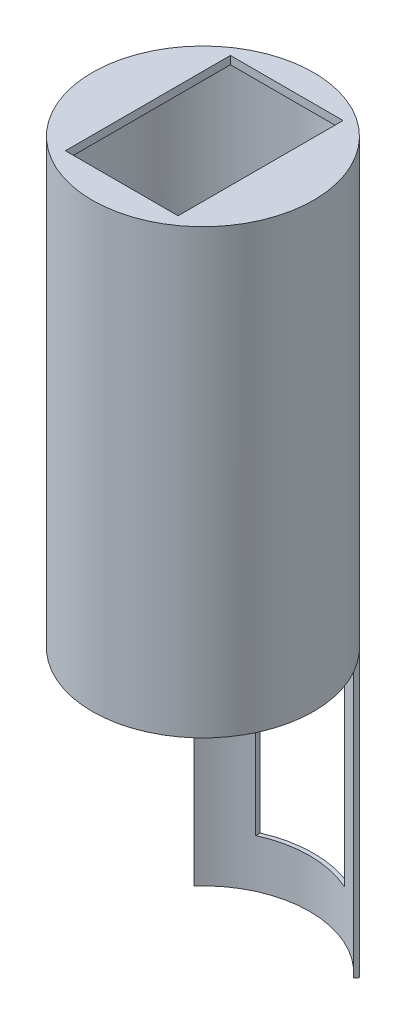
ISO-10303-21;
HEADER;
FILE_DESCRIPTION(('STEP AP214'),'2;1');
FILE_NAME('part.step','',(''),(''),'','','');
FILE_SCHEMA(('AUTOMOTIVE_DESIGN { 1 0 10303 214 1 1 1 1 }'));
ENDSEC;
DATA;
#1=APPLICATION_CONTEXT('core data for automotive mechanical design processes');
#2=APPLICATION_PROTOCOL_DEFINITION('international standard','automotive_design',2000,#1);
#3=PRODUCT_CONTEXT('',#1,'mechanical');
#4=PRODUCT('Part','Part','',(#3));
#5=PRODUCT_RELATED_PRODUCT_CATEGORY('part','',(#4));
#6=PRODUCT_DEFINITION_FORMATION('','',#4);
#7=PRODUCT_DEFINITION_CONTEXT('part definition',#1,'design');
#8=PRODUCT_DEFINITION('design','',#6,#7);
#9=PRODUCT_DEFINITION_SHAPE('','',#8);
#10=(LENGTH_UNIT() NAMED_UNIT(*) SI_UNIT(.MILLI.,.METRE.));
#11=(NAMED_UNIT(*) PLANE_ANGLE_UNIT() SI_UNIT($,.RADIAN.));
#12=(NAMED_UNIT(*) SI_UNIT($,.STERADIAN.) SOLID_ANGLE_UNIT());
#13=UNCERTAINTY_MEASURE_WITH_UNIT(LENGTH_MEASURE(1.E-05),#10,'distance_accuracy_value','');
#14=(GEOMETRIC_REPRESENTATION_CONTEXT(3) GLOBAL_UNCERTAINTY_ASSIGNED_CONTEXT((#13)) GLOBAL_UNIT_ASSIGNED_CONTEXT((#10,
#11,#12)) REPRESENTATION_CONTEXT('',''));
#15=CARTESIAN_POINT('',(0.,0.,0.));
#16=DIRECTION('',(0.,0.,1.));
#17=DIRECTION('',(1.,0.,0.));
#18=AXIS2_PLACEMENT_3D('',#15,#16,#17);
#19=CARTESIAN_POINT('',(0.,110.,0.));
#20=DIRECTION('',(0.,1.,0.));
#21=DIRECTION('',(0.,0.,1.));
#22=AXIS2_PLACEMENT_3D('',#19,#20,#21);
#23=PLANE('',#22);
#24=CARTESIAN_POINT('',(0.,110.,0.));
#25=DIRECTION('',(0.,1.,0.));
#26=DIRECTION('',(0.,0.,1.));
#27=AXIS2_PLACEMENT_3D('',#24,#25,#26);
#28=CIRCLE('',#27,27.5);
#29=CARTESIAN_POINT('',(0.,110.,27.5));
#30=VERTEX_POINT('',#29);
#31=EDGE_CURVE('E223',#30,#30,#28,.T.);
#32=ORIENTED_EDGE('',*,*,#31,.T.);
#33=EDGE_LOOP('',(#32));
#34=FACE_BOUND('',#33,.T.);
#35=DIRECTION('',(-1.,0.,0.));
#36=VECTOR('',#35,1.);
#37=CARTESIAN_POINT('',(0.,110.,20.1795265690119));
#38=LINE('',#37,#36);
#39=CARTESIAN_POINT('',(14.,110.,20.1795265690119));
#40=VERTEX_POINT('',#39);
#41=CARTESIAN_POINT('',(-14.,110.,20.1795265690119));
#42=VERTEX_POINT('',#41);
#43=EDGE_CURVE('E143',#40,#42,#38,.T.);
#44=ORIENTED_EDGE('',*,*,#43,.T.);
#45=DIRECTION('',(0.,0.,-1.));
#46=VECTOR('',#45,1.);
#47=CARTESIAN_POINT('',(-14.,110.,0.));
#48=LINE('',#47,#46);
#49=CARTESIAN_POINT('',(-14.,110.,-20.8204734309881));
#50=VERTEX_POINT('',#49);
#51=EDGE_CURVE('E136',#42,#50,#48,.T.);
#52=ORIENTED_EDGE('',*,*,#51,.T.);
#53=DIRECTION('',(1.,0.,0.));
#54=VECTOR('',#53,1.);
#55=CARTESIAN_POINT('',(0.,110.,-20.8204734309881));
#56=LINE('',#55,#54);
#57=CARTESIAN_POINT('',(14.,110.,-20.8204734309881));
#58=VERTEX_POINT('',#57);
#59=EDGE_CURVE('E124',#50,#58,#56,.T.);
#60=ORIENTED_EDGE('',*,*,#59,.T.);
#61=DIRECTION('',(0.,0.,1.));
#62=VECTOR('',#61,1.);
#63=CARTESIAN_POINT('',(14.,110.,0.));
#64=LINE('',#63,#62);
#65=EDGE_CURVE('E130',#58,#40,#64,.T.);
#66=ORIENTED_EDGE('',*,*,#65,.T.);
#67=EDGE_LOOP('',(#44,#52,#60,#66));
#68=FACE_BOUND('',#67,.T.);
#69=ADVANCED_FACE('F38',(#34,#68),#23,.T.);
#70=CARTESIAN_POINT('',(0.,108.,0.));
#71=DIRECTION('',(0.,1.,0.));
#72=DIRECTION('',(0.,0.,1.));
#73=AXIS2_PLACEMENT_3D('',#70,#71,#72);
#74=PLANE('',#73);
#75=CARTESIAN_POINT('',(0.,108.,0.));
#76=DIRECTION('',(0.,1.,0.));
#77=DIRECTION('',(0.,0.,1.));
#78=AXIS2_PLACEMENT_3D('',#75,#76,#77);
#79=CIRCLE('',#78,26.5);
#80=CARTESIAN_POINT('',(0.,108.,26.5));
#81=VERTEX_POINT('',#80);
#82=EDGE_CURVE('E205',#81,#81,#79,.T.);
#83=ORIENTED_EDGE('',*,*,#82,.F.);
#84=EDGE_LOOP('',(#83));
#85=FACE_BOUND('',#84,.T.);
#86=DIRECTION('',(0.,0.,-1.));
#87=VECTOR('',#86,1.);
#88=CARTESIAN_POINT('',(-14.,108.,0.));
#89=LINE('',#88,#87);
#90=CARTESIAN_POINT('',(-14.,108.,20.1795265690119));
#91=VERTEX_POINT('',#90);
#92=CARTESIAN_POINT('',(-14.,108.,-20.8204734309881));
#93=VERTEX_POINT('',#92);
#94=EDGE_CURVE('E11',#91,#93,#89,.T.);
#95=ORIENTED_EDGE('',*,*,#94,.F.);
#96=DIRECTION('',(-1.,0.,0.));
#97=VECTOR('',#96,1.);
#98=CARTESIAN_POINT('',(0.,108.,20.1795265690119));
#99=LINE('',#98,#97);
#100=CARTESIAN_POINT('',(14.,108.,20.1795265690119));
#101=VERTEX_POINT('',#100);
#102=EDGE_CURVE('E47',#101,#91,#99,.T.);
#103=ORIENTED_EDGE('',*,*,#102,.F.);
#104=DIRECTION('',(0.,0.,1.));
#105=VECTOR('',#104,1.);
#106=CARTESIAN_POINT('',(14.,108.,0.));
#107=LINE('',#106,#105);
#108=CARTESIAN_POINT('',(14.,108.,-20.8204734309881));
#109=VERTEX_POINT('',#108);
#110=EDGE_CURVE('E252',#109,#101,#107,.T.);
#111=ORIENTED_EDGE('',*,*,#110,.F.);
#112=DIRECTION('',(1.,0.,0.));
#113=VECTOR('',#112,1.);
#114=CARTESIAN_POINT('',(0.,108.,-20.8204734309881));
#115=LINE('',#114,#113);
#116=EDGE_CURVE('E249',#93,#109,#115,.T.);
#117=ORIENTED_EDGE('',*,*,#116,.F.);
#118=EDGE_LOOP('',(#95,#103,#111,#117));
#119=FACE_BOUND('',#118,.T.);
#120=ADVANCED_FACE('F265',(#85,#119),#74,.F.);
#121=CARTESIAN_POINT('',(0.,-70.,0.));
#122=DIRECTION('',(0.,1.,0.));
#123=DIRECTION('',(0.,0.,1.));
#124=AXIS2_PLACEMENT_3D('',#121,#122,#123);
#125=CYLINDRICAL_SURFACE('',#124,27.5);
#126=CARTESIAN_POINT('',(0.,-58.,0.));
#127=DIRECTION('',(0.,-1.,0.));
#128=DIRECTION('',(0.,0.,-1.));
#129=AXIS2_PLACEMENT_3D('',#126,#127,#128);
#130=CIRCLE('',#129,27.5);
#131=CARTESIAN_POINT('',(11.,-58.,-25.2041663222571));
#132=VERTEX_POINT('',#131);
#133=CARTESIAN_POINT('',(-11.,-58.,-25.2041663222571));
#134=VERTEX_POINT('',#133);
#135=EDGE_CURVE('E170',#132,#134,#130,.F.);
#136=ORIENTED_EDGE('',*,*,#135,.F.);
#137=DIRECTION('',(0.,1.,0.));
#138=VECTOR('',#137,1.);
#139=CARTESIAN_POINT('',(11.,-70.,-25.2041663222571));
#140=LINE('',#139,#138);
#141=CARTESIAN_POINT('',(11.,-10.,-25.2041663222571));
#142=VERTEX_POINT('',#141);
#143=EDGE_CURVE('E173',#142,#132,#140,.F.);
#144=ORIENTED_EDGE('',*,*,#143,.F.);
#145=CARTESIAN_POINT('',(0.,-10.,0.));
#146=DIRECTION('',(0.,-1.,0.));
#147=DIRECTION('',(0.,0.,-1.));
#148=AXIS2_PLACEMENT_3D('',#145,#146,#147);
#149=CIRCLE('',#148,27.5);
#150=CARTESIAN_POINT('',(-11.,-10.,-25.2041663222571));
#151=VERTEX_POINT('',#150);
#152=EDGE_CURVE('E162',#142,#151,#149,.F.);
#153=ORIENTED_EDGE('',*,*,#152,.T.);
#154=DIRECTION('',(0.,1.,0.));
#155=VECTOR('',#154,1.);
#156=CARTESIAN_POINT('',(-11.,-70.,-25.2041663222571));
#157=LINE('',#156,#155);
#158=EDGE_CURVE('E176',#134,#151,#157,.T.);
#159=ORIENTED_EDGE('',*,*,#158,.F.);
#160=EDGE_LOOP('',(#136,#144,#153,#159));
#161=FACE_BOUND('',#160,.T.);
#162=DIRECTION('',(0.,1.,0.));
#163=VECTOR('',#162,1.);
#164=CARTESIAN_POINT('',(-20.4463973813533,-70.,-18.3900743370925));
#165=LINE('',#164,#163);
#166=CARTESIAN_POINT('',(-20.4463973813533,-70.,-18.3900743370925));
#167=VERTEX_POINT('',#166);
#168=CARTESIAN_POINT('',(-20.4463973813533,0.,-18.3900743370925));
#169=VERTEX_POINT('',#168);
#170=EDGE_CURVE('E201',#167,#169,#165,.T.);
#171=ORIENTED_EDGE('',*,*,#170,.T.);
#172=CARTESIAN_POINT('',(0.,0.,0.));
#173=DIRECTION('',(0.,1.,0.));
#174=DIRECTION('',(0.,0.,1.));
#175=AXIS2_PLACEMENT_3D('',#172,#173,#174);
#176=CIRCLE('',#175,27.5);
#177=CARTESIAN_POINT('',(20.4463973813534,0.,-18.3900743370925));
#178=VERTEX_POINT('',#177);
#179=EDGE_CURVE('E180',#169,#178,#176,.T.);
#180=ORIENTED_EDGE('',*,*,#179,.T.);
#181=DIRECTION('',(0.,1.,0.));
#182=VECTOR('',#181,1.);
#183=CARTESIAN_POINT('',(20.4463973813534,-70.,-18.3900743370925));
#184=LINE('',#183,#182);
#185=CARTESIAN_POINT('',(20.4463973813534,-70.,-18.3900743370925));
#186=VERTEX_POINT('',#185);
#187=EDGE_CURVE('E190',#186,#178,#184,.T.);
#188=ORIENTED_EDGE('',*,*,#187,.F.);
#189=CARTESIAN_POINT('',(0.,-70.,0.));
#190=DIRECTION('',(0.,1.,0.));
#191=DIRECTION('',(0.,0.,1.));
#192=AXIS2_PLACEMENT_3D('',#189,#190,#191);
#193=CIRCLE('',#192,27.5);
#194=EDGE_CURVE('E227',#186,#167,#193,.T.);
#195=ORIENTED_EDGE('',*,*,#194,.T.);
#196=EDGE_LOOP('',(#171,#180,#188,#195));
#197=FACE_BOUND('',#196,.T.);
#198=ORIENTED_EDGE('',*,*,#31,.F.);
#199=EDGE_LOOP('',(#198));
#200=FACE_BOUND('',#199,.T.);
#201=ADVANCED_FACE('F40',(#161,#197,#200),#125,.T.);
#202=CARTESIAN_POINT('',(0.,-70.,0.));
#203=DIRECTION('',(0.,1.,0.));
#204=DIRECTION('',(0.,0.,1.));
#205=AXIS2_PLACEMENT_3D('',#202,#203,#204);
#206=PLANE('',#205);
#207=CARTESIAN_POINT('',(0.,-70.,0.));
#208=DIRECTION('',(0.,1.,0.));
#209=DIRECTION('',(0.,0.,1.));
#210=AXIS2_PLACEMENT_3D('',#207,#208,#209);
#211=CIRCLE('',#210,26.5);
#212=CARTESIAN_POINT('',(19.7940495323758,-70.,-17.6194665954976));
#213=VERTEX_POINT('',#212);
#214=CARTESIAN_POINT('',(-19.7940495323758,-70.,-17.6194665954976));
#215=VERTEX_POINT('',#214);
#216=EDGE_CURVE('E219',#213,#215,#211,.T.);
#217=ORIENTED_EDGE('',*,*,#216,.T.);
#218=DIRECTION('',(-0.64611257942307,0.,-0.763242120634905));
#219=VECTOR('',#218,1.);
#220=CARTESIAN_POINT('',(-20.4463973813533,-70.,-18.3900743370925));
#221=LINE('',#220,#219);
#222=EDGE_CURVE('E185',#215,#167,#221,.T.);
#223=ORIENTED_EDGE('',*,*,#222,.T.);
#224=ORIENTED_EDGE('',*,*,#194,.F.);
#225=DIRECTION('',(-0.64611257942307,0.,0.763242120634905));
#226=VECTOR('',#225,1.);
#227=CARTESIAN_POINT('',(20.4463973813534,-70.,-18.3900743370925));
#228=LINE('',#227,#226);
#229=EDGE_CURVE('E181',#186,#213,#228,.T.);
#230=ORIENTED_EDGE('',*,*,#229,.T.);
#231=EDGE_LOOP('',(#217,#223,#224,#230));
#232=FACE_BOUND('',#231,.T.);
#233=ADVANCED_FACE('F292',(#232),#206,.F.);
#234=CARTESIAN_POINT('',(0.,-70.,0.));
#235=DIRECTION('',(0.,1.,0.));
#236=DIRECTION('',(0.,0.,1.));
#237=AXIS2_PLACEMENT_3D('',#234,#235,#236);
#238=CYLINDRICAL_SURFACE('',#237,26.5);
#239=DIRECTION('',(0.,1.,0.));
#240=VECTOR('',#239,1.);
#241=CARTESIAN_POINT('',(11.,-70.,-24.1091269024824));
#242=LINE('',#241,#240);
#243=CARTESIAN_POINT('',(11.,-10.,-24.1091269024824));
#244=VERTEX_POINT('',#243);
#245=CARTESIAN_POINT('',(11.,-58.,-24.1091269024824));
#246=VERTEX_POINT('',#245);
#247=EDGE_CURVE('E237',#244,#246,#242,.F.);
#248=ORIENTED_EDGE('',*,*,#247,.T.);
#249=CARTESIAN_POINT('',(0.,-58.,0.));
#250=DIRECTION('',(0.,-1.,0.));
#251=DIRECTION('',(0.,0.,-1.));
#252=AXIS2_PLACEMENT_3D('',#249,#250,#251);
#253=CIRCLE('',#252,26.5);
#254=CARTESIAN_POINT('',(-11.,-58.,-24.1091269024824));
#255=VERTEX_POINT('',#254);
#256=EDGE_CURVE('E245',#246,#255,#253,.F.);
#257=ORIENTED_EDGE('',*,*,#256,.T.);
#258=DIRECTION('',(0.,1.,0.));
#259=VECTOR('',#258,1.);
#260=CARTESIAN_POINT('',(-11.,-70.,-24.1091269024824));
#261=LINE('',#260,#259);
#262=CARTESIAN_POINT('',(-11.,-10.,-24.1091269024824));
#263=VERTEX_POINT('',#262);
#264=EDGE_CURVE('E241',#255,#263,#261,.T.);
#265=ORIENTED_EDGE('',*,*,#264,.T.);
#266=CARTESIAN_POINT('',(0.,-10.,0.));
#267=DIRECTION('',(0.,-1.,0.));
#268=DIRECTION('',(0.,0.,-1.));
#269=AXIS2_PLACEMENT_3D('',#266,#267,#268);
#270=CIRCLE('',#269,26.5);
#271=EDGE_CURVE('E234',#244,#263,#270,.F.);
#272=ORIENTED_EDGE('',*,*,#271,.F.);
#273=EDGE_LOOP('',(#248,#257,#265,#272));
#274=FACE_BOUND('',#273,.T.);
#275=CARTESIAN_POINT('',(0.,0.,0.));
#276=DIRECTION('',(0.,-1.,0.));
#277=DIRECTION('',(0.,0.,-1.));
#278=AXIS2_PLACEMENT_3D('',#275,#276,#277);
#279=CIRCLE('',#278,26.5);
#280=CARTESIAN_POINT('',(-19.7940495323758,0.,-17.6194665954976));
#281=VERTEX_POINT('',#280);
#282=CARTESIAN_POINT('',(19.7940495323758,0.,-17.6194665954976));
#283=VERTEX_POINT('',#282);
#284=EDGE_CURVE('E231',#281,#283,#279,.F.);
#285=ORIENTED_EDGE('',*,*,#284,.F.);
#286=DIRECTION('',(0.,1.,0.));
#287=VECTOR('',#286,1.);
#288=CARTESIAN_POINT('',(-19.7940495323758,-70.,-17.6194665954976));
#289=LINE('',#288,#287);
#290=EDGE_CURVE('E206',#215,#281,#289,.T.);
#291=ORIENTED_EDGE('',*,*,#290,.F.);
#292=ORIENTED_EDGE('',*,*,#216,.F.);
#293=DIRECTION('',(0.,1.,0.));
#294=VECTOR('',#293,1.);
#295=CARTESIAN_POINT('',(19.7940495323758,-70.,-17.6194665954976));
#296=LINE('',#295,#294);
#297=EDGE_CURVE('E210',#213,#283,#296,.T.);
#298=ORIENTED_EDGE('',*,*,#297,.T.);
#299=EDGE_LOOP('',(#285,#291,#292,#298));
#300=FACE_BOUND('',#299,.T.);
#301=ORIENTED_EDGE('',*,*,#82,.T.);
#302=EDGE_LOOP('',(#301));
#303=FACE_BOUND('',#302,.T.);
#304=ADVANCED_FACE('F291',(#274,#300,#303),#238,.F.);
#305=CARTESIAN_POINT('',(0.,0.,0.));
#306=DIRECTION('',(0.,-1.,0.));
#307=DIRECTION('',(0.,0.,-1.));
#308=AXIS2_PLACEMENT_3D('',#305,#306,#307);
#309=PLANE('',#308);
#310=ORIENTED_EDGE('',*,*,#284,.T.);
#311=DIRECTION('',(-0.64611257942307,0.,0.763242120634905));
#312=VECTOR('',#311,1.);
#313=CARTESIAN_POINT('',(20.4463973813534,0.,-18.3900743370925));
#314=LINE('',#313,#312);
#315=EDGE_CURVE('E194',#178,#283,#314,.T.);
#316=ORIENTED_EDGE('',*,*,#315,.F.);
#317=ORIENTED_EDGE('',*,*,#179,.F.);
#318=DIRECTION('',(-0.64611257942307,0.,-0.763242120634905));
#319=VECTOR('',#318,1.);
#320=CARTESIAN_POINT('',(-20.4463973813533,0.,-18.3900743370925));
#321=LINE('',#320,#319);
#322=EDGE_CURVE('E186',#281,#169,#321,.T.);
#323=ORIENTED_EDGE('',*,*,#322,.F.);
#324=EDGE_LOOP('',(#310,#316,#317,#323));
#325=FACE_BOUND('',#324,.T.);
#326=ADVANCED_FACE('F299',(#325),#309,.T.);
#327=CARTESIAN_POINT('',(-20.4463973813533,-70.,-18.3900743370925));
#328=DIRECTION('',(0.763242120634905,0.,-0.64611257942307));
#329=DIRECTION('',(-0.64611257942307,0.,-0.763242120634905));
#330=AXIS2_PLACEMENT_3D('',#327,#328,#329);
#331=PLANE('',#330);
#332=ORIENTED_EDGE('',*,*,#322,.T.);
#333=ORIENTED_EDGE('',*,*,#170,.F.);
#334=ORIENTED_EDGE('',*,*,#222,.F.);
#335=ORIENTED_EDGE('',*,*,#290,.T.);
#336=EDGE_LOOP('',(#332,#333,#334,#335));
#337=FACE_BOUND('',#336,.T.);
#338=ADVANCED_FACE('F309',(#337),#331,.F.);
#339=CARTESIAN_POINT('',(20.4463973813534,-70.,-18.3900743370925));
#340=DIRECTION('',(-0.763242120634905,0.,-0.64611257942307));
#341=DIRECTION('',(-0.64611257942307,0.,0.763242120634905));
#342=AXIS2_PLACEMENT_3D('',#339,#340,#341);
#343=PLANE('',#342);
#344=ORIENTED_EDGE('',*,*,#315,.T.);
#345=ORIENTED_EDGE('',*,*,#297,.F.);
#346=ORIENTED_EDGE('',*,*,#229,.F.);
#347=ORIENTED_EDGE('',*,*,#187,.T.);
#348=EDGE_LOOP('',(#344,#345,#346,#347));
#349=FACE_BOUND('',#348,.T.);
#350=ADVANCED_FACE('F316',(#349),#343,.F.);
#351=CARTESIAN_POINT('',(-11.,-58.,-17.9106241321993));
#352=DIRECTION('',(-1.,0.,0.));
#353=DIRECTION('',(0.,0.,1.));
#354=AXIS2_PLACEMENT_3D('',#351,#352,#353);
#355=PLANE('',#354);
#356=ORIENTED_EDGE('',*,*,#158,.T.);
#357=DIRECTION('',(0.,0.,1.));
#358=VECTOR('',#357,1.);
#359=CARTESIAN_POINT('',(-11.,-10.,-17.9106241321993));
#360=LINE('',#359,#358);
#361=EDGE_CURVE('E145',#151,#263,#360,.T.);
#362=ORIENTED_EDGE('',*,*,#361,.T.);
#363=ORIENTED_EDGE('',*,*,#264,.F.);
#364=DIRECTION('',(0.,0.,1.));
#365=VECTOR('',#364,1.);
#366=CARTESIAN_POINT('',(-11.,-58.,-17.9106241321993));
#367=LINE('',#366,#365);
#368=EDGE_CURVE('E155',#134,#255,#367,.T.);
#369=ORIENTED_EDGE('',*,*,#368,.F.);
#370=EDGE_LOOP('',(#356,#362,#363,#369));
#371=FACE_BOUND('',#370,.T.);
#372=ADVANCED_FACE('F318',(#371),#355,.F.);
#373=CARTESIAN_POINT('',(11.,-58.,-17.9106241321993));
#374=DIRECTION('',(1.,0.,0.));
#375=DIRECTION('',(0.,0.,-1.));
#376=AXIS2_PLACEMENT_3D('',#373,#374,#375);
#377=PLANE('',#376);
#378=ORIENTED_EDGE('',*,*,#143,.T.);
#379=DIRECTION('',(0.,0.,-1.));
#380=VECTOR('',#379,1.);
#381=CARTESIAN_POINT('',(11.,-58.,-17.9106241321993));
#382=LINE('',#381,#380);
#383=EDGE_CURVE('E159',#246,#132,#382,.T.);
#384=ORIENTED_EDGE('',*,*,#383,.F.);
#385=ORIENTED_EDGE('',*,*,#247,.F.);
#386=DIRECTION('',(0.,0.,-1.));
#387=VECTOR('',#386,1.);
#388=CARTESIAN_POINT('',(11.,-10.,-17.9106241321993));
#389=LINE('',#388,#387);
#390=EDGE_CURVE('E150',#244,#142,#389,.T.);
#391=ORIENTED_EDGE('',*,*,#390,.T.);
#392=EDGE_LOOP('',(#378,#384,#385,#391));
#393=FACE_BOUND('',#392,.T.);
#394=ADVANCED_FACE('F324',(#393),#377,.F.);
#395=CARTESIAN_POINT('',(0.,-58.,0.));
#396=DIRECTION('',(0.,-1.,0.));
#397=DIRECTION('',(0.,0.,-1.));
#398=AXIS2_PLACEMENT_3D('',#395,#396,#397);
#399=PLANE('',#398);
#400=ORIENTED_EDGE('',*,*,#135,.T.);
#401=ORIENTED_EDGE('',*,*,#368,.T.);
#402=ORIENTED_EDGE('',*,*,#256,.F.);
#403=ORIENTED_EDGE('',*,*,#383,.T.);
#404=EDGE_LOOP('',(#400,#401,#402,#403));
#405=FACE_BOUND('',#404,.T.);
#406=ADVANCED_FACE('F333',(#405),#399,.F.);
#407=CARTESIAN_POINT('',(0.,-10.,0.));
#408=DIRECTION('',(0.,-1.,0.));
#409=DIRECTION('',(0.,0.,-1.));
#410=AXIS2_PLACEMENT_3D('',#407,#408,#409);
#411=PLANE('',#410);
#412=ORIENTED_EDGE('',*,*,#390,.F.);
#413=ORIENTED_EDGE('',*,*,#271,.T.);
#414=ORIENTED_EDGE('',*,*,#361,.F.);
#415=ORIENTED_EDGE('',*,*,#152,.F.);
#416=EDGE_LOOP('',(#412,#413,#414,#415));
#417=FACE_BOUND('',#416,.T.);
#418=ADVANCED_FACE('F335',(#417),#411,.T.);
#419=CARTESIAN_POINT('',(-14.,119.,-20.8204734309881));
#420=DIRECTION('',(1.,0.,0.));
#421=DIRECTION('',(0.,0.,-1.));
#422=AXIS2_PLACEMENT_3D('',#419,#420,#421);
#423=PLANE('',#422);
#424=DIRECTION('',(0.,-1.,0.));
#425=VECTOR('',#424,1.);
#426=CARTESIAN_POINT('',(-14.,119.,20.1795265690119));
#427=LINE('',#426,#425);
#428=EDGE_CURVE('E131',#42,#91,#427,.T.);
#429=ORIENTED_EDGE('',*,*,#428,.T.);
#430=ORIENTED_EDGE('',*,*,#94,.T.);
#431=DIRECTION('',(0.,-1.,0.));
#432=VECTOR('',#431,1.);
#433=CARTESIAN_POINT('',(-14.,119.,-20.8204734309881));
#434=LINE('',#433,#432);
#435=EDGE_CURVE('E59',#50,#93,#434,.T.);
#436=ORIENTED_EDGE('',*,*,#435,.F.);
#437=ORIENTED_EDGE('',*,*,#51,.F.);
#438=EDGE_LOOP('',(#429,#430,#436,#437));
#439=FACE_BOUND('',#438,.T.);
#440=ADVANCED_FACE('F135',(#439),#423,.T.);
#441=CARTESIAN_POINT('',(-14.,119.,20.1795265690119));
#442=DIRECTION('',(0.,0.,-1.));
#443=DIRECTION('',(-1.,0.,0.));
#444=AXIS2_PLACEMENT_3D('',#441,#442,#443);
#445=PLANE('',#444);
#446=DIRECTION('',(0.,-1.,0.));
#447=VECTOR('',#446,1.);
#448=CARTESIAN_POINT('',(14.,119.,20.1795265690119));
#449=LINE('',#448,#447);
#450=EDGE_CURVE('E260',#40,#101,#449,.T.);
#451=ORIENTED_EDGE('',*,*,#450,.T.);
#452=ORIENTED_EDGE('',*,*,#102,.T.);
#453=ORIENTED_EDGE('',*,*,#428,.F.);
#454=ORIENTED_EDGE('',*,*,#43,.F.);
#455=EDGE_LOOP('',(#451,#452,#453,#454));
#456=FACE_BOUND('',#455,.T.);
#457=ADVANCED_FACE('F258',(#456),#445,.T.);
#458=CARTESIAN_POINT('',(14.,119.,-20.8204734309881));
#459=DIRECTION('',(-1.,0.,0.));
#460=DIRECTION('',(0.,0.,1.));
#461=AXIS2_PLACEMENT_3D('',#458,#459,#460);
#462=PLANE('',#461);
#463=DIRECTION('',(0.,-1.,0.));
#464=VECTOR('',#463,1.);
#465=CARTESIAN_POINT('',(14.,119.,-20.8204734309881));
#466=LINE('',#465,#464);
#467=EDGE_CURVE('E54',#58,#109,#466,.T.);
#468=ORIENTED_EDGE('',*,*,#467,.T.);
#469=ORIENTED_EDGE('',*,*,#110,.T.);
#470=ORIENTED_EDGE('',*,*,#450,.F.);
#471=ORIENTED_EDGE('',*,*,#65,.F.);
#472=EDGE_LOOP('',(#468,#469,#470,#471));
#473=FACE_BOUND('',#472,.T.);
#474=ADVANCED_FACE('F267',(#473),#462,.T.);
#475=CARTESIAN_POINT('',(14.,119.,-20.8204734309881));
#476=DIRECTION('',(0.,0.,1.));
#477=DIRECTION('',(1.,0.,0.));
#478=AXIS2_PLACEMENT_3D('',#475,#476,#477);
#479=PLANE('',#478);
#480=ORIENTED_EDGE('',*,*,#435,.T.);
#481=ORIENTED_EDGE('',*,*,#116,.T.);
#482=ORIENTED_EDGE('',*,*,#467,.F.);
#483=ORIENTED_EDGE('',*,*,#59,.F.);
#484=EDGE_LOOP('',(#480,#481,#482,#483));
#485=FACE_BOUND('',#484,.T.);
#486=ADVANCED_FACE('F125',(#485),#479,.T.);
#487=CLOSED_SHELL('',(#69,#120,#201,#233,#304,#326,#338,#350,#372,#394,#406,#418,#440,#457,#474,#486));
#488=MANIFOLD_SOLID_BREP('B2',#487);
#489=ADVANCED_BREP_SHAPE_REPRESENTATION('',(#18,#488),#14);
#490=SHAPE_DEFINITION_REPRESENTATION(#9,#489);
ENDSEC;
END-ISO-10303-21;
